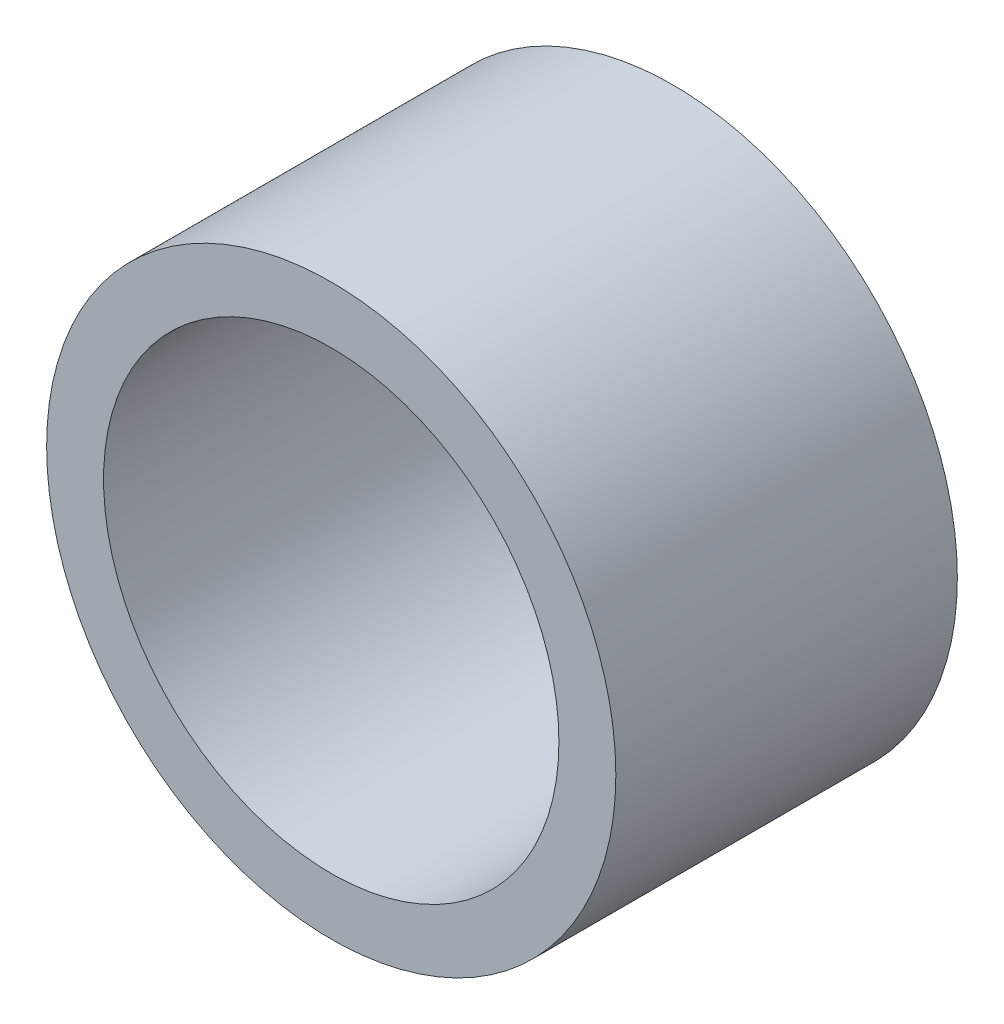
ISO-10303-21;
HEADER;
FILE_DESCRIPTION(('STEP AP214'),'2;1');
FILE_NAME('part.step','',(''),(''),'','','');
FILE_SCHEMA(('AUTOMOTIVE_DESIGN { 1 0 10303 214 1 1 1 1 }'));
ENDSEC;
DATA;
#1=APPLICATION_CONTEXT('core data for automotive mechanical design processes');
#2=APPLICATION_PROTOCOL_DEFINITION('international standard','automotive_design',2000,#1);
#3=PRODUCT_CONTEXT('',#1,'mechanical');
#4=PRODUCT('Part','Part','',(#3));
#5=PRODUCT_RELATED_PRODUCT_CATEGORY('part','',(#4));
#6=PRODUCT_DEFINITION_FORMATION('','',#4);
#7=PRODUCT_DEFINITION_CONTEXT('part definition',#1,'design');
#8=PRODUCT_DEFINITION('design','',#6,#7);
#9=PRODUCT_DEFINITION_SHAPE('','',#8);
#10=(LENGTH_UNIT() NAMED_UNIT(*) SI_UNIT(.MILLI.,.METRE.));
#11=(NAMED_UNIT(*) PLANE_ANGLE_UNIT() SI_UNIT($,.RADIAN.));
#12=(NAMED_UNIT(*) SI_UNIT($,.STERADIAN.) SOLID_ANGLE_UNIT());
#13=UNCERTAINTY_MEASURE_WITH_UNIT(LENGTH_MEASURE(1.E-05),#10,'distance_accuracy_value','');
#14=(GEOMETRIC_REPRESENTATION_CONTEXT(3) GLOBAL_UNCERTAINTY_ASSIGNED_CONTEXT((#13)) GLOBAL_UNIT_ASSIGNED_CONTEXT((#10,
#11,#12)) REPRESENTATION_CONTEXT('',''));
#15=CARTESIAN_POINT('',(0.,0.,0.));
#16=DIRECTION('',(0.,0.,1.));
#17=DIRECTION('',(1.,0.,0.));
#18=AXIS2_PLACEMENT_3D('',#15,#16,#17);
#19=CARTESIAN_POINT('',(0.,0.,9.525));
#20=DIRECTION('',(0.,0.,1.));
#21=DIRECTION('',(1.,0.,0.));
#22=AXIS2_PLACEMENT_3D('',#19,#20,#21);
#23=PLANE('',#22);
#24=CARTESIAN_POINT('',(0.,0.,9.525));
#25=DIRECTION('',(0.,0.,1.));
#26=DIRECTION('',(1.,0.,0.));
#27=AXIS2_PLACEMENT_3D('',#24,#25,#26);
#28=CIRCLE('',#27,7.9375);
#29=CARTESIAN_POINT('',(7.9375,0.,9.525));
#30=VERTEX_POINT('',#29);
#31=EDGE_CURVE('E10',#30,#30,#28,.T.);
#32=ORIENTED_EDGE('',*,*,#31,.T.);
#33=EDGE_LOOP('',(#32));
#34=FACE_BOUND('',#33,.T.);
#35=CARTESIAN_POINT('',(0.,0.,9.525));
#36=DIRECTION('',(0.,0.,1.));
#37=DIRECTION('',(1.,0.,0.));
#38=AXIS2_PLACEMENT_3D('',#35,#36,#37);
#39=CIRCLE('',#38,6.35);
#40=CARTESIAN_POINT('',(6.35,0.,9.525));
#41=VERTEX_POINT('',#40);
#42=EDGE_CURVE('E41',#41,#41,#39,.T.);
#43=ORIENTED_EDGE('',*,*,#42,.F.);
#44=EDGE_LOOP('',(#43));
#45=FACE_BOUND('',#44,.T.);
#46=ADVANCED_FACE('F30',(#34,#45),#23,.T.);
#47=CARTESIAN_POINT('',(0.,0.,0.));
#48=DIRECTION('',(0.,0.,1.));
#49=DIRECTION('',(1.,0.,0.));
#50=AXIS2_PLACEMENT_3D('',#47,#48,#49);
#51=PLANE('',#50);
#52=CARTESIAN_POINT('',(0.,0.,0.));
#53=DIRECTION('',(0.,0.,1.));
#54=DIRECTION('',(1.,0.,0.));
#55=AXIS2_PLACEMENT_3D('',#52,#53,#54);
#56=CIRCLE('',#55,7.9375);
#57=CARTESIAN_POINT('',(7.9375,0.,0.));
#58=VERTEX_POINT('',#57);
#59=EDGE_CURVE('E34',#58,#58,#56,.T.);
#60=ORIENTED_EDGE('',*,*,#59,.F.);
#61=EDGE_LOOP('',(#60));
#62=FACE_BOUND('',#61,.T.);
#63=CARTESIAN_POINT('',(0.,0.,0.));
#64=DIRECTION('',(0.,0.,1.));
#65=DIRECTION('',(1.,0.,0.));
#66=AXIS2_PLACEMENT_3D('',#63,#64,#65);
#67=CIRCLE('',#66,6.35);
#68=CARTESIAN_POINT('',(6.35,0.,0.));
#69=VERTEX_POINT('',#68);
#70=EDGE_CURVE('E43',#69,#69,#67,.T.);
#71=ORIENTED_EDGE('',*,*,#70,.T.);
#72=EDGE_LOOP('',(#71));
#73=FACE_BOUND('',#72,.T.);
#74=ADVANCED_FACE('F53',(#62,#73),#51,.F.);
#75=CARTESIAN_POINT('',(0.,0.,9.525));
#76=DIRECTION('',(0.,0.,-1.));
#77=DIRECTION('',(-1.,0.,0.));
#78=AXIS2_PLACEMENT_3D('',#75,#76,#77);
#79=CYLINDRICAL_SURFACE('',#78,7.9375);
#80=ORIENTED_EDGE('',*,*,#31,.F.);
#81=EDGE_LOOP('',(#80));
#82=FACE_BOUND('',#81,.T.);
#83=ORIENTED_EDGE('',*,*,#59,.T.);
#84=EDGE_LOOP('',(#83));
#85=FACE_BOUND('',#84,.T.);
#86=ADVANCED_FACE('F32',(#82,#85),#79,.T.);
#87=CARTESIAN_POINT('',(0.,0.,9.525));
#88=DIRECTION('',(0.,0.,-1.));
#89=DIRECTION('',(-1.,0.,0.));
#90=AXIS2_PLACEMENT_3D('',#87,#88,#89);
#91=CYLINDRICAL_SURFACE('',#90,6.35);
#92=ORIENTED_EDGE('',*,*,#42,.T.);
#93=EDGE_LOOP('',(#92));
#94=FACE_BOUND('',#93,.T.);
#95=ORIENTED_EDGE('',*,*,#70,.F.);
#96=EDGE_LOOP('',(#95));
#97=FACE_BOUND('',#96,.T.);
#98=ADVANCED_FACE('F49',(#94,#97),#91,.F.);
#99=CLOSED_SHELL('',(#46,#74,#86,#98));
#100=MANIFOLD_SOLID_BREP('B2',#99);
#101=ADVANCED_BREP_SHAPE_REPRESENTATION('',(#18,#100),#14);
#102=SHAPE_DEFINITION_REPRESENTATION(#9,#101);
ENDSEC;
END-ISO-10303-21;
